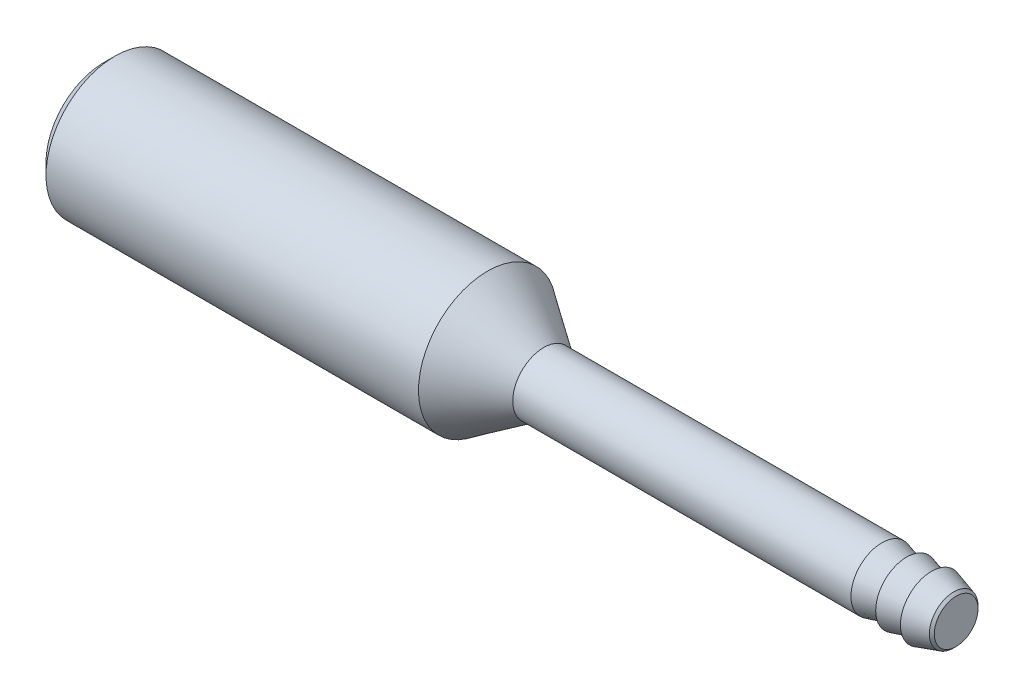
ISO-10303-21;
HEADER;
FILE_DESCRIPTION(('STEP AP214'),'2;1');
FILE_NAME('part.step','',(''),(''),'','','');
FILE_SCHEMA(('AUTOMOTIVE_DESIGN { 1 0 10303 214 1 1 1 1 }'));
ENDSEC;
DATA;
#1=APPLICATION_CONTEXT('core data for automotive mechanical design processes');
#2=APPLICATION_PROTOCOL_DEFINITION('international standard','automotive_design',2000,#1);
#3=PRODUCT_CONTEXT('',#1,'mechanical');
#4=PRODUCT('Part','Part','',(#3));
#5=PRODUCT_RELATED_PRODUCT_CATEGORY('part','',(#4));
#6=PRODUCT_DEFINITION_FORMATION('','',#4);
#7=PRODUCT_DEFINITION_CONTEXT('part definition',#1,'design');
#8=PRODUCT_DEFINITION('design','',#6,#7);
#9=PRODUCT_DEFINITION_SHAPE('','',#8);
#10=(LENGTH_UNIT() NAMED_UNIT(*) SI_UNIT(.MILLI.,.METRE.));
#11=(NAMED_UNIT(*) PLANE_ANGLE_UNIT() SI_UNIT($,.RADIAN.));
#12=(NAMED_UNIT(*) SI_UNIT($,.STERADIAN.) SOLID_ANGLE_UNIT());
#13=UNCERTAINTY_MEASURE_WITH_UNIT(LENGTH_MEASURE(1.E-05),#10,'distance_accuracy_value','');
#14=(GEOMETRIC_REPRESENTATION_CONTEXT(3) GLOBAL_UNCERTAINTY_ASSIGNED_CONTEXT((#13)) GLOBAL_UNIT_ASSIGNED_CONTEXT((#10,
#11,#12)) REPRESENTATION_CONTEXT('',''));
#15=CARTESIAN_POINT('',(0.,0.,0.));
#16=DIRECTION('',(0.,0.,1.));
#17=DIRECTION('',(1.,0.,0.));
#18=AXIS2_PLACEMENT_3D('',#15,#16,#17);
#19=CARTESIAN_POINT('',(0.,0.975000000000001,0.));
#20=DIRECTION('',(-1.,0.,0.));
#21=DIRECTION('',(0.,-1.,0.));
#22=AXIS2_PLACEMENT_3D('',#19,#20,#21);
#23=PLANE('',#22);
#24=CARTESIAN_POINT('',(0.,0.,0.));
#25=DIRECTION('',(-1.,0.,0.));
#26=DIRECTION('',(0.,-1.,0.));
#27=AXIS2_PLACEMENT_3D('',#24,#25,#26);
#28=CIRCLE('',#27,0.617500000032578);
#29=CARTESIAN_POINT('',(0.,-0.617500000032578,0.));
#30=VERTEX_POINT('',#29);
#31=EDGE_CURVE('E17',#30,#30,#28,.T.);
#32=ORIENTED_EDGE('',*,*,#31,.F.);
#33=EDGE_LOOP('',(#32));
#34=FACE_BOUND('',#33,.T.);
#35=ADVANCED_FACE('F14',(#34),#23,.F.);
#36=CARTESIAN_POINT('',(-0.0700000000506407,0.,0.));
#37=DIRECTION('',(-1.,0.,0.));
#38=DIRECTION('',(0.,-1.,0.));
#39=AXIS2_PLACEMENT_3D('',#36,#37,#38);
#40=CONICAL_SURFACE('',#39,0.687500000026375,0.785398162991424);
#41=CARTESIAN_POINT('',(-0.0700000000506407,0.,0.));
#42=DIRECTION('',(-1.,0.,0.));
#43=DIRECTION('',(0.,-1.,0.));
#44=AXIS2_PLACEMENT_3D('',#41,#42,#43);
#45=CIRCLE('',#44,0.687499999997954);
#46=CARTESIAN_POINT('',(-0.0700000000506407,-0.687499999997954,0.));
#47=VERTEX_POINT('',#46);
#48=EDGE_CURVE('E36',#47,#47,#45,.T.);
#49=ORIENTED_EDGE('',*,*,#48,.F.);
#50=EDGE_LOOP('',(#49));
#51=FACE_BOUND('',#50,.T.);
#52=ORIENTED_EDGE('',*,*,#31,.T.);
#53=EDGE_LOOP('',(#52));
#54=FACE_BOUND('',#53,.T.);
#55=ADVANCED_FACE('F58',(#51,#54),#40,.T.);
#56=CARTESIAN_POINT('',(-0.699999999937973,0.,0.));
#57=DIRECTION('',(-1.,0.,0.));
#58=DIRECTION('',(0.,-1.,0.));
#59=AXIS2_PLACEMENT_3D('',#56,#57,#58);
#60=CONICAL_SURFACE('',#59,0.874999999950887,0.289271005581513);
#61=CARTESIAN_POINT('',(-0.699999999994816,0.,0.));
#62=DIRECTION('',(-1.,0.,0.));
#63=DIRECTION('',(0.,-1.,0.));
#64=AXIS2_PLACEMENT_3D('',#61,#62,#63);
#65=CIRCLE('',#64,0.874999999967805);
#66=CARTESIAN_POINT('',(-0.699999999994816,-0.874999999967805,0.));
#67=VERTEX_POINT('',#66);
#68=EDGE_CURVE('E39',#67,#67,#65,.T.);
#69=ORIENTED_EDGE('',*,*,#68,.F.);
#70=EDGE_LOOP('',(#69));
#71=FACE_BOUND('',#70,.T.);
#72=ORIENTED_EDGE('',*,*,#48,.T.);
#73=EDGE_LOOP('',(#72));
#74=FACE_BOUND('',#73,.T.);
#75=ADVANCED_FACE('F55',(#71,#74),#60,.T.);
#76=CARTESIAN_POINT('',(-0.699999999999999,0.974999999999997,0.));
#77=DIRECTION('',(-1.,0.,0.));
#78=DIRECTION('',(0.,-1.,0.));
#79=AXIS2_PLACEMENT_3D('',#76,#77,#78);
#80=PLANE('',#79);
#81=ORIENTED_EDGE('',*,*,#68,.T.);
#82=EDGE_LOOP('',(#81));
#83=FACE_BOUND('',#82,.T.);
#84=CARTESIAN_POINT('',(-0.700000000051659,0.,0.));
#85=DIRECTION('',(-1.,0.,0.));
#86=DIRECTION('',(0.,0.,1.));
#87=AXIS2_PLACEMENT_3D('',#84,#85,#86);
#88=CIRCLE('',#87,0.687500000026375);
#89=CARTESIAN_POINT('',(-0.700000000051659,0.,0.687500000026375));
#90=VERTEX_POINT('',#89);
#91=EDGE_CURVE('E47',#90,#90,#88,.T.);
#92=ORIENTED_EDGE('',*,*,#91,.F.);
#93=EDGE_LOOP('',(#92));
#94=FACE_BOUND('',#93,.T.);
#95=ADVANCED_FACE('F52',(#83,#94),#80,.T.);
#96=CARTESIAN_POINT('',(-1.39999999993279,0.,0.));
#97=DIRECTION('',(-1.,0.,0.));
#98=DIRECTION('',(0.,0.,1.));
#99=AXIS2_PLACEMENT_3D('',#96,#97,#98);
#100=CONICAL_SURFACE('',#99,0.87500000000773,0.261713502418794);
#101=CARTESIAN_POINT('',(-1.39999999998963,0.,0.));
#102=DIRECTION('',(-1.,0.,0.));
#103=DIRECTION('',(0.,0.,1.));
#104=AXIS2_PLACEMENT_3D('',#101,#102,#103);
#105=CIRCLE('',#104,0.875000000022956);
#106=CARTESIAN_POINT('',(-1.39999999998963,0.,0.875000000022956));
#107=VERTEX_POINT('',#106);
#108=EDGE_CURVE('E44',#107,#107,#105,.T.);
#109=ORIENTED_EDGE('',*,*,#108,.F.);
#110=EDGE_LOOP('',(#109));
#111=FACE_BOUND('',#110,.T.);
#112=ORIENTED_EDGE('',*,*,#91,.T.);
#113=EDGE_LOOP('',(#112));
#114=FACE_BOUND('',#113,.T.);
#115=ADVANCED_FACE('F102',(#111,#114),#100,.T.);
#116=CARTESIAN_POINT('',(-1.4,0.974999999999997,0.));
#117=DIRECTION('',(-1.,0.,0.));
#118=DIRECTION('',(0.,-1.,0.));
#119=AXIS2_PLACEMENT_3D('',#116,#117,#118);
#120=PLANE('',#119);
#121=ORIENTED_EDGE('',*,*,#108,.T.);
#122=EDGE_LOOP('',(#121));
#123=FACE_BOUND('',#122,.T.);
#124=CARTESIAN_POINT('',(-1.40000000004647,0.,0.));
#125=DIRECTION('',(-1.,0.,0.));
#126=DIRECTION('',(0.,0.,1.));
#127=AXIS2_PLACEMENT_3D('',#124,#125,#126);
#128=CIRCLE('',#127,0.687500000026375);
#129=CARTESIAN_POINT('',(-1.40000000004647,0.,0.687500000026375));
#130=VERTEX_POINT('',#129);
#131=EDGE_CURVE('E35',#130,#130,#128,.T.);
#132=ORIENTED_EDGE('',*,*,#131,.F.);
#133=EDGE_LOOP('',(#132));
#134=FACE_BOUND('',#133,.T.);
#135=ADVANCED_FACE('F98',(#123,#134),#120,.T.);
#136=CARTESIAN_POINT('',(-2.10000000004129,0.,0.));
#137=DIRECTION('',(-1.,0.,0.));
#138=DIRECTION('',(0.,0.,1.));
#139=AXIS2_PLACEMENT_3D('',#136,#137,#138);
#140=CONICAL_SURFACE('',#139,0.87500000000773,0.261713502378204);
#141=CARTESIAN_POINT('',(-2.1,0.,0.));
#142=DIRECTION('',(1.,0.,0.));
#143=DIRECTION('',(0.,1.,0.));
#144=AXIS2_PLACEMENT_3D('',#141,#142,#143);
#145=CIRCLE('',#144,0.875000000000001);
#146=CARTESIAN_POINT('',(-2.1,0.875000000000001,0.));
#147=VERTEX_POINT('',#146);
#148=EDGE_CURVE('E32',#147,#147,#145,.F.);
#149=ORIENTED_EDGE('',*,*,#148,.F.);
#150=EDGE_LOOP('',(#149));
#151=FACE_BOUND('',#150,.T.);
#152=ORIENTED_EDGE('',*,*,#131,.T.);
#153=EDGE_LOOP('',(#152));
#154=FACE_BOUND('',#153,.T.);
#155=ADVANCED_FACE('F94',(#151,#154),#140,.T.);
#156=CARTESIAN_POINT('',(-24.1,0.974999999999997,0.));
#157=DIRECTION('',(-1.,0.,0.));
#158=DIRECTION('',(0.,-1.,0.));
#159=AXIS2_PLACEMENT_3D('',#156,#157,#158);
#160=PLANE('',#159);
#161=CARTESIAN_POINT('',(-24.0999999999758,0.,0.));
#162=DIRECTION('',(1.,0.,0.));
#163=DIRECTION('',(0.,0.,-1.));
#164=AXIS2_PLACEMENT_3D('',#161,#162,#163);
#165=CIRCLE('',#164,1.62999999992053);
#166=CARTESIAN_POINT('',(-24.0999999999758,0.,-1.62999999992053));
#167=VERTEX_POINT('',#166);
#168=EDGE_CURVE('E31',#167,#167,#165,.T.);
#169=ORIENTED_EDGE('',*,*,#168,.F.);
#170=EDGE_LOOP('',(#169));
#171=FACE_BOUND('',#170,.T.);
#172=ADVANCED_FACE('F90',(#171),#160,.T.);
#173=CARTESIAN_POINT('',(0.,0.,0.));
#174=DIRECTION('',(1.,0.,0.));
#175=DIRECTION('',(0.,1.,0.));
#176=AXIS2_PLACEMENT_3D('',#173,#174,#175);
#177=CYLINDRICAL_SURFACE('',#176,0.875000000000001);
#178=ORIENTED_EDGE('',*,*,#148,.T.);
#179=EDGE_LOOP('',(#178));
#180=FACE_BOUND('',#179,.T.);
#181=CARTESIAN_POINT('',(-11.6600000000631,0.,0.));
#182=DIRECTION('',(-1.,0.,0.));
#183=DIRECTION('',(0.,-1.,0.));
#184=AXIS2_PLACEMENT_3D('',#181,#182,#183);
#185=CIRCLE('',#184,0.875000000007729);
#186=CARTESIAN_POINT('',(-11.6600000000631,-0.875000000007731,0.));
#187=VERTEX_POINT('',#186);
#188=EDGE_CURVE('E26',#187,#187,#185,.T.);
#189=ORIENTED_EDGE('',*,*,#188,.F.);
#190=EDGE_LOOP('',(#189));
#191=FACE_BOUND('',#190,.T.);
#192=ADVANCED_FACE('F86',(#180,#191),#177,.T.);
#193=CARTESIAN_POINT('',(-23.7799999999311,0.,0.));
#194=DIRECTION('',(1.,0.,0.));
#195=DIRECTION('',(0.,0.,-1.));
#196=AXIS2_PLACEMENT_3D('',#193,#194,#195);
#197=CONICAL_SURFACE('',#196,1.94999999996526,0.785398163397448);
#198=CARTESIAN_POINT('',(-23.78,0.,0.));
#199=DIRECTION('',(1.,0.,0.));
#200=DIRECTION('',(0.,1.,0.));
#201=AXIS2_PLACEMENT_3D('',#198,#199,#200);
#202=CIRCLE('',#201,1.95);
#203=CARTESIAN_POINT('',(-23.78,1.95,0.));
#204=VERTEX_POINT('',#203);
#205=EDGE_CURVE('E21',#204,#204,#202,.T.);
#206=ORIENTED_EDGE('',*,*,#205,.F.);
#207=EDGE_LOOP('',(#206));
#208=FACE_BOUND('',#207,.T.);
#209=ORIENTED_EDGE('',*,*,#168,.T.);
#210=EDGE_LOOP('',(#209));
#211=FACE_BOUND('',#210,.T.);
#212=ADVANCED_FACE('F79',(#208,#211),#197,.T.);
#213=CARTESIAN_POINT('',(-13.2500000000277,0.,0.));
#214=DIRECTION('',(-1.,0.,0.));
#215=DIRECTION('',(0.,0.,1.));
#216=AXIS2_PLACEMENT_3D('',#213,#214,#215);
#217=CONICAL_SURFACE('',#216,1.94999999996526,0.594505402043502);
#218=CARTESIAN_POINT('',(-13.25,0.,0.));
#219=DIRECTION('',(1.,0.,0.));
#220=DIRECTION('',(0.,1.,0.));
#221=AXIS2_PLACEMENT_3D('',#218,#219,#220);
#222=CIRCLE('',#221,1.95);
#223=CARTESIAN_POINT('',(-13.25,1.95,0.));
#224=VERTEX_POINT('',#223);
#225=EDGE_CURVE('E10',#224,#224,#222,.F.);
#226=ORIENTED_EDGE('',*,*,#225,.F.);
#227=EDGE_LOOP('',(#226));
#228=FACE_BOUND('',#227,.T.);
#229=ORIENTED_EDGE('',*,*,#188,.T.);
#230=EDGE_LOOP('',(#229));
#231=FACE_BOUND('',#230,.T.);
#232=ADVANCED_FACE('F73',(#228,#231),#217,.T.);
#233=CARTESIAN_POINT('',(0.,0.,0.));
#234=DIRECTION('',(1.,0.,0.));
#235=DIRECTION('',(0.,1.,0.));
#236=AXIS2_PLACEMENT_3D('',#233,#234,#235);
#237=CYLINDRICAL_SURFACE('',#236,1.95);
#238=ORIENTED_EDGE('',*,*,#225,.T.);
#239=EDGE_LOOP('',(#238));
#240=FACE_BOUND('',#239,.T.);
#241=ORIENTED_EDGE('',*,*,#205,.T.);
#242=EDGE_LOOP('',(#241));
#243=FACE_BOUND('',#242,.T.);
#244=ADVANCED_FACE('F71',(#240,#243),#237,.T.);
#245=CLOSED_SHELL('',(#35,#55,#75,#95,#115,#135,#155,#172,#192,#212,#232,#244));
#246=MANIFOLD_SOLID_BREP('B1',#245);
#247=ADVANCED_BREP_SHAPE_REPRESENTATION('',(#18,#246),#14);
#248=SHAPE_DEFINITION_REPRESENTATION(#9,#247);
ENDSEC;
END-ISO-10303-21;
